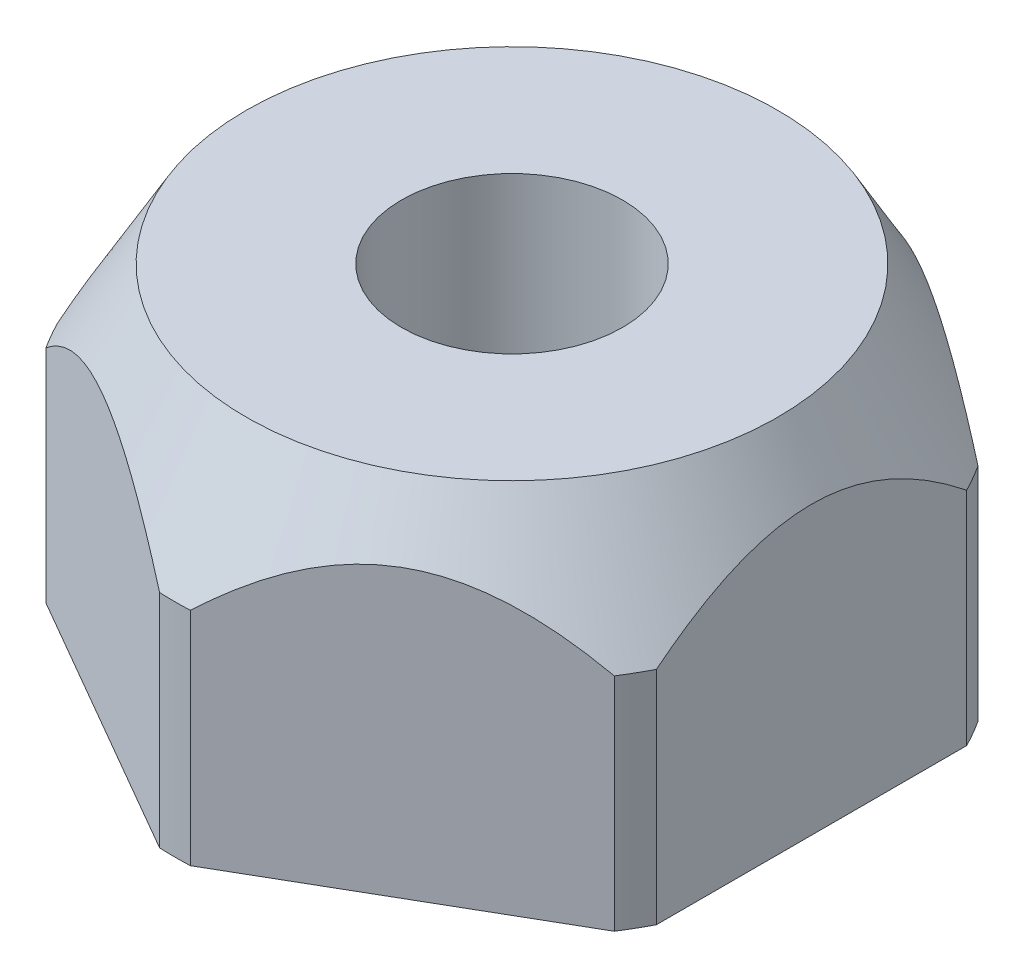
ISO-10303-21;
HEADER;
FILE_DESCRIPTION(('STEP AP214'),'2;1');
FILE_NAME('part.step','',(''),(''),'','','');
FILE_SCHEMA(('AUTOMOTIVE_DESIGN { 1 0 10303 214 1 1 1 1 }'));
ENDSEC;
DATA;
#1=APPLICATION_CONTEXT('core data for automotive mechanical design processes');
#2=APPLICATION_PROTOCOL_DEFINITION('international standard','automotive_design',2000,#1);
#3=PRODUCT_CONTEXT('',#1,'mechanical');
#4=PRODUCT('Part','Part','',(#3));
#5=PRODUCT_RELATED_PRODUCT_CATEGORY('part','',(#4));
#6=PRODUCT_DEFINITION_FORMATION('','',#4);
#7=PRODUCT_DEFINITION_CONTEXT('part definition',#1,'design');
#8=PRODUCT_DEFINITION('design','',#6,#7);
#9=PRODUCT_DEFINITION_SHAPE('','',#8);
#10=(LENGTH_UNIT() NAMED_UNIT(*) SI_UNIT(.MILLI.,.METRE.));
#11=(NAMED_UNIT(*) PLANE_ANGLE_UNIT() SI_UNIT($,.RADIAN.));
#12=(NAMED_UNIT(*) SI_UNIT($,.STERADIAN.) SOLID_ANGLE_UNIT());
#13=UNCERTAINTY_MEASURE_WITH_UNIT(LENGTH_MEASURE(1.E-05),#10,'distance_accuracy_value','');
#14=(GEOMETRIC_REPRESENTATION_CONTEXT(3) GLOBAL_UNCERTAINTY_ASSIGNED_CONTEXT((#13)) GLOBAL_UNIT_ASSIGNED_CONTEXT((#10,
#11,#12)) REPRESENTATION_CONTEXT('',''));
#15=CARTESIAN_POINT('',(0.,0.,0.));
#16=DIRECTION('',(0.,0.,1.));
#17=DIRECTION('',(1.,0.,0.));
#18=AXIS2_PLACEMENT_3D('',#15,#16,#17);
#19=CARTESIAN_POINT('',(0.,4.5212,0.));
#20=DIRECTION('',(0.,1.,0.));
#21=DIRECTION('',(-1.,0.,0.));
#22=AXIS2_PLACEMENT_3D('',#19,#20,#21);
#23=CYLINDRICAL_SURFACE('',#22,4.4196);
#24=DIRECTION('',(0.,1.,0.));
#25=VECTOR('',#24,1.);
#26=CARTESIAN_POINT('',(3.72270396182565,4.5212,-2.38208718828837));
#27=LINE('',#26,#25);
#28=CARTESIAN_POINT('',(3.72270396182565,2.89764571680006,-2.38208718828837));
#29=VERTEX_POINT('',#28);
#30=CARTESIAN_POINT('',(3.72270396182565,0.,-2.38208718828837));
#31=VERTEX_POINT('',#30);
#32=EDGE_CURVE('E199',#29,#31,#27,.F.);
#33=ORIENTED_EDGE('',*,*,#32,.F.);
#34=CARTESIAN_POINT('',(0.,2.89764571680006,0.));
#35=DIRECTION('',(0.,1.,0.));
#36=DIRECTION('',(-1.,0.,0.));
#37=AXIS2_PLACEMENT_3D('',#34,#35,#36);
#38=CIRCLE('',#37,4.4196);
#39=CARTESIAN_POINT('',(3.9243,2.89764571680006,-2.03291260756581));
#40=VERTEX_POINT('',#39);
#41=EDGE_CURVE('E175',#40,#29,#38,.T.);
#42=ORIENTED_EDGE('',*,*,#41,.F.);
#43=DIRECTION('',(0.,1.,0.));
#44=VECTOR('',#43,1.);
#45=CARTESIAN_POINT('',(3.9243,4.5212,-2.03291260756581));
#46=LINE('',#45,#44);
#47=CARTESIAN_POINT('',(3.9243,0.,-2.03291260756581));
#48=VERTEX_POINT('',#47);
#49=EDGE_CURVE('E157',#48,#40,#46,.T.);
#50=ORIENTED_EDGE('',*,*,#49,.F.);
#51=CARTESIAN_POINT('',(0.,0.,0.));
#52=DIRECTION('',(0.,1.,0.));
#53=DIRECTION('',(-1.,0.,0.));
#54=AXIS2_PLACEMENT_3D('',#51,#52,#53);
#55=CIRCLE('',#54,4.4196);
#56=EDGE_CURVE('E173',#48,#31,#55,.T.);
#57=ORIENTED_EDGE('',*,*,#56,.T.);
#58=EDGE_LOOP('',(#33,#42,#50,#57));
#59=FACE_BOUND('',#58,.T.);
#60=ADVANCED_FACE('F42',(#59),#23,.T.);
#61=DIRECTION('',(0.,1.,0.));
#62=VECTOR('',#61,1.);
#63=CARTESIAN_POINT('',(0.201596038174351,4.5212,-4.41499979585417));
#64=LINE('',#63,#62);
#65=CARTESIAN_POINT('',(0.201596038174351,0.,-4.41499979585417));
#66=VERTEX_POINT('',#65);
#67=CARTESIAN_POINT('',(0.201596038174351,2.89764571680006,-4.41499979585417));
#68=VERTEX_POINT('',#67);
#69=EDGE_CURVE('E240',#66,#68,#64,.T.);
#70=ORIENTED_EDGE('',*,*,#69,.F.);
#71=CARTESIAN_POINT('',(-0.201596038174352,0.,-4.41499979585417));
#72=VERTEX_POINT('',#71);
#73=EDGE_CURVE('E185',#66,#72,#55,.T.);
#74=ORIENTED_EDGE('',*,*,#73,.T.);
#75=DIRECTION('',(0.,1.,0.));
#76=VECTOR('',#75,1.);
#77=CARTESIAN_POINT('',(-0.201596038174351,4.5212,-4.41499979585417));
#78=LINE('',#77,#76);
#79=CARTESIAN_POINT('',(-0.201596038174351,2.89764571680006,-4.41499979585417));
#80=VERTEX_POINT('',#79);
#81=EDGE_CURVE('E70',#80,#72,#78,.F.);
#82=ORIENTED_EDGE('',*,*,#81,.F.);
#83=EDGE_CURVE('E367',#68,#80,#38,.T.);
#84=ORIENTED_EDGE('',*,*,#83,.F.);
#85=EDGE_LOOP('',(#70,#74,#82,#84));
#86=FACE_BOUND('',#85,.T.);
#87=ADVANCED_FACE('F280',(#86),#23,.T.);
#88=DIRECTION('',(0.,1.,0.));
#89=VECTOR('',#88,1.);
#90=CARTESIAN_POINT('',(-3.72270396182565,4.5212,-2.38208718828837));
#91=LINE('',#90,#89);
#92=CARTESIAN_POINT('',(-3.72270396182565,0.,-2.38208718828837));
#93=VERTEX_POINT('',#92);
#94=CARTESIAN_POINT('',(-3.72270396182565,2.89764571680006,-2.38208718828837));
#95=VERTEX_POINT('',#94);
#96=EDGE_CURVE('E227',#93,#95,#91,.T.);
#97=ORIENTED_EDGE('',*,*,#96,.F.);
#98=CARTESIAN_POINT('',(-3.9243,0.,-2.0329126075658));
#99=VERTEX_POINT('',#98);
#100=EDGE_CURVE('E193',#93,#99,#55,.T.);
#101=ORIENTED_EDGE('',*,*,#100,.T.);
#102=DIRECTION('',(0.,1.,0.));
#103=VECTOR('',#102,1.);
#104=CARTESIAN_POINT('',(-3.9243,4.5212,-2.0329126075658));
#105=LINE('',#104,#103);
#106=CARTESIAN_POINT('',(-3.9243,2.89764571680006,-2.0329126075658));
#107=VERTEX_POINT('',#106);
#108=EDGE_CURVE('E61',#107,#99,#105,.F.);
#109=ORIENTED_EDGE('',*,*,#108,.F.);
#110=EDGE_CURVE('E212',#95,#107,#38,.T.);
#111=ORIENTED_EDGE('',*,*,#110,.F.);
#112=EDGE_LOOP('',(#97,#101,#109,#111));
#113=FACE_BOUND('',#112,.T.);
#114=ADVANCED_FACE('F233',(#113),#23,.T.);
#115=DIRECTION('',(0.,1.,0.));
#116=VECTOR('',#115,1.);
#117=CARTESIAN_POINT('',(-3.9243,4.5212,2.0329126075658));
#118=LINE('',#117,#116);
#119=CARTESIAN_POINT('',(-3.9243,0.,2.0329126075658));
#120=VERTEX_POINT('',#119);
#121=CARTESIAN_POINT('',(-3.9243,2.89764571680005,2.03291260756582));
#122=VERTEX_POINT('',#121);
#123=EDGE_CURVE('E356',#120,#122,#118,.T.);
#124=ORIENTED_EDGE('',*,*,#123,.F.);
#125=CARTESIAN_POINT('',(-3.72270396182565,0.,2.38208718828837));
#126=VERTEX_POINT('',#125);
#127=EDGE_CURVE('E194',#120,#126,#55,.T.);
#128=ORIENTED_EDGE('',*,*,#127,.T.);
#129=DIRECTION('',(0.,1.,0.));
#130=VECTOR('',#129,1.);
#131=CARTESIAN_POINT('',(-3.72270396182565,4.5212,2.38208718828837));
#132=LINE('',#131,#130);
#133=CARTESIAN_POINT('',(-3.72270396182565,2.89764571680006,2.38208718828837));
#134=VERTEX_POINT('',#133);
#135=EDGE_CURVE('E321',#134,#126,#132,.F.);
#136=ORIENTED_EDGE('',*,*,#135,.F.);
#137=EDGE_CURVE('E167',#122,#134,#38,.T.);
#138=ORIENTED_EDGE('',*,*,#137,.F.);
#139=EDGE_LOOP('',(#124,#128,#136,#138));
#140=FACE_BOUND('',#139,.T.);
#141=ADVANCED_FACE('F291',(#140),#23,.T.);
#142=DIRECTION('',(0.,1.,0.));
#143=VECTOR('',#142,1.);
#144=CARTESIAN_POINT('',(-0.20159603817435,4.5212,4.41499979585417));
#145=LINE('',#144,#143);
#146=CARTESIAN_POINT('',(-0.201596038174349,0.,4.41499979585417));
#147=VERTEX_POINT('',#146);
#148=CARTESIAN_POINT('',(-0.20159603817435,2.89764571680006,4.41499979585417));
#149=VERTEX_POINT('',#148);
#150=EDGE_CURVE('E312',#147,#149,#145,.T.);
#151=ORIENTED_EDGE('',*,*,#150,.F.);
#152=CARTESIAN_POINT('',(0.201596038174345,0.,4.41499979585417));
#153=VERTEX_POINT('',#152);
#154=EDGE_CURVE('E190',#147,#153,#55,.T.);
#155=ORIENTED_EDGE('',*,*,#154,.T.);
#156=DIRECTION('',(0.,1.,0.));
#157=VECTOR('',#156,1.);
#158=CARTESIAN_POINT('',(0.201596038174346,4.5212,4.41499979585417));
#159=LINE('',#158,#157);
#160=CARTESIAN_POINT('',(0.201596038174346,2.89764571680006,4.41499979585417));
#161=VERTEX_POINT('',#160);
#162=EDGE_CURVE('E301',#161,#153,#159,.F.);
#163=ORIENTED_EDGE('',*,*,#162,.F.);
#164=EDGE_CURVE('E214',#149,#161,#38,.T.);
#165=ORIENTED_EDGE('',*,*,#164,.F.);
#166=EDGE_LOOP('',(#151,#155,#163,#165));
#167=FACE_BOUND('',#166,.T.);
#168=ADVANCED_FACE('F286',(#167),#23,.T.);
#169=DIRECTION('',(0.,1.,0.));
#170=VECTOR('',#169,1.);
#171=CARTESIAN_POINT('',(3.72270396182565,4.5212,2.38208718828837));
#172=LINE('',#171,#170);
#173=CARTESIAN_POINT('',(3.72270396182565,0.,2.38208718828837));
#174=VERTEX_POINT('',#173);
#175=CARTESIAN_POINT('',(3.72270396182565,2.89764571680006,2.38208718828837));
#176=VERTEX_POINT('',#175);
#177=EDGE_CURVE('E295',#174,#176,#172,.T.);
#178=ORIENTED_EDGE('',*,*,#177,.F.);
#179=CARTESIAN_POINT('',(3.9243,0.,2.03291260756581));
#180=VERTEX_POINT('',#179);
#181=EDGE_CURVE('E184',#174,#180,#55,.T.);
#182=ORIENTED_EDGE('',*,*,#181,.T.);
#183=DIRECTION('',(0.,1.,0.));
#184=VECTOR('',#183,1.);
#185=CARTESIAN_POINT('',(3.9243,4.5212,2.03291260756581));
#186=LINE('',#185,#184);
#187=CARTESIAN_POINT('',(3.9243,2.89764571680005,2.03291260756583));
#188=VERTEX_POINT('',#187);
#189=EDGE_CURVE('E160',#188,#180,#186,.F.);
#190=ORIENTED_EDGE('',*,*,#189,.F.);
#191=EDGE_CURVE('E297',#176,#188,#38,.T.);
#192=ORIENTED_EDGE('',*,*,#191,.F.);
#193=EDGE_LOOP('',(#178,#182,#190,#192));
#194=FACE_BOUND('',#193,.T.);
#195=ADVANCED_FACE('F44',(#194),#23,.T.);
#196=CARTESIAN_POINT('',(0.,4.5212,0.));
#197=DIRECTION('',(0.,-1.,0.));
#198=DIRECTION('',(1.,0.,0.));
#199=AXIS2_PLACEMENT_3D('',#196,#197,#198);
#200=CONICAL_SURFACE('',#199,3.48224049755053,0.523598775598307);
#201=CARTESIAN_POINT('',(0.201378646395307,2.89744571680006,-4.41512530705632));
#202=CARTESIAN_POINT('',(0.243002688833909,2.93573712645072,-4.39109365494964));
#203=CARTESIAN_POINT('',(0.285074251898576,2.97337922098922,-4.36680362668902));
#204=CARTESIAN_POINT('',(0.370206681949156,3.04717777314053,-4.31765239528255));
#205=CARTESIAN_POINT('',(0.413267908892586,3.08333367642834,-4.29279098431513));
#206=CARTESIAN_POINT('',(0.544599933654743,3.18971037495322,-4.21696640446548));
#207=CARTESIAN_POINT('',(0.634477673899376,3.25733473471823,-4.16507546694109));
#208=CARTESIAN_POINT('',(0.821144915873365,3.38487757851598,-4.05730308453852));
#209=CARTESIAN_POINT('',(0.918046421063457,3.44458078367558,-4.00135697443214));
#210=CARTESIAN_POINT('',(1.11680543627588,3.55102543367785,-3.88660340349538));
#211=CARTESIAN_POINT('',(1.218647548972,3.59780444515529,-3.82780483231544));
#212=CARTESIAN_POINT('',(1.43529451423899,3.67787617965486,-3.70272364859942));
#213=CARTESIAN_POINT('',(1.55048857316493,3.70981655679631,-3.63621632766949));
#214=CARTESIAN_POINT('',(1.78281413271054,3.74995513125242,-3.5020831033262));
#215=CARTESIAN_POINT('',(1.89991230733974,3.7584005945101,-3.43447644068241));
#216=CARTESIAN_POINT('',(2.13361293691471,3.75090530137457,-3.29954931928752));
#217=CARTESIAN_POINT('',(2.2502147736126,3.73493996899139,-3.23222921748199));
#218=CARTESIAN_POINT('',(2.4806112780335,3.68075542544333,-3.09920973363423));
#219=CARTESIAN_POINT('',(2.59436313462659,3.64230230903893,-3.0335350686094));
#220=CARTESIAN_POINT('',(2.79918417335044,3.55483104413837,-2.91528158676648));
#221=CARTESIAN_POINT('',(2.89107892955647,3.50829606479648,-2.86222612453382));
#222=CARTESIAN_POINT('',(3.07070088952971,3.40515033107087,-2.75852133759089));
#223=CARTESIAN_POINT('',(3.1584193246077,3.34851946739325,-2.70787707548573));
#224=CARTESIAN_POINT('',(3.32771219466592,3.22903572151362,-2.61013579138573));
#225=CARTESIAN_POINT('',(3.40938284458361,3.16636154115019,-2.56298321967086));
#226=CARTESIAN_POINT('',(3.56883955872649,3.03560761551068,-2.47092084283637));
#227=CARTESIAN_POINT('',(3.64664238475491,2.96755525608414,-2.42600136028515));
#228=CARTESIAN_POINT('',(3.7229213536047,2.89744571680005,-2.38196167708622));
#229=B_SPLINE_CURVE_WITH_KNOTS('',3,(#201,#202,#203,#204,#205,#206,#207,#208,#209,#210,#211,
#212,#213,#214,#215,#216,#217,#218,#219,#220,#221,#222,#223,#224,#225,#226,#227,#228),
.UNSPECIFIED.,.F.,.F.,(4,2,2,2,2,2,2,2,2,2,2,2,2,4),(0.,0.184345090143029,0.368758325377625,
0.739992068313383,1.11984200873029,1.49857594003078,1.90713875884581,2.3113852005117,
2.71603889232377,3.12497836793815,3.4719638581063,3.81964836787163,4.15911497599774,
4.49695241990035),.UNSPECIFIED.);
#230=EDGE_CURVE('E245',#68,#29,#229,.T.);
#231=ORIENTED_EDGE('',*,*,#230,.F.);
#232=ORIENTED_EDGE('',*,*,#83,.T.);
#233=CARTESIAN_POINT('',(-3.7229213536047,2.89744571680005,-2.38196167708622));
#234=CARTESIAN_POINT('',(-3.6812973111661,2.93573712645071,-2.4059933291929));
#235=CARTESIAN_POINT('',(-3.63922574810143,2.97337922098922,-2.43028335745352));
#236=CARTESIAN_POINT('',(-3.55409331805085,3.04717777314052,-2.47943458885999));
#237=CARTESIAN_POINT('',(-3.51103209110742,3.08333367642834,-2.50429599982741));
#238=CARTESIAN_POINT('',(-3.37970006634527,3.18971037495322,-2.58012057967706));
#239=CARTESIAN_POINT('',(-3.28982232610063,3.25733473471822,-2.63201151720146));
#240=CARTESIAN_POINT('',(-3.10315508412664,3.38487757851598,-2.73978389960402));
#241=CARTESIAN_POINT('',(-3.00625357893655,3.44458078367558,-2.7957300097104));
#242=CARTESIAN_POINT('',(-2.80749456372413,3.55102543367784,-2.91048358064716));
#243=CARTESIAN_POINT('',(-2.70565245102801,3.59780444515529,-2.9692821518271));
#244=CARTESIAN_POINT('',(-2.48900548576102,3.67787617965485,-3.09436333554312));
#245=CARTESIAN_POINT('',(-2.37381142683508,3.70981655679631,-3.16087065647305));
#246=CARTESIAN_POINT('',(-2.14148586728947,3.74995513125242,-3.29500388081634));
#247=CARTESIAN_POINT('',(-2.02438769266027,3.7584005945101,-3.36261054346013));
#248=CARTESIAN_POINT('',(-1.7906870630853,3.75090530137457,-3.49753766485502));
#249=CARTESIAN_POINT('',(-1.67408522638741,3.7349399689914,-3.56485776666055));
#250=CARTESIAN_POINT('',(-1.44368872196651,3.68075542544333,-3.69787725050831));
#251=CARTESIAN_POINT('',(-1.32993686537342,3.64230230903893,-3.76355191553314));
#252=CARTESIAN_POINT('',(-1.12511582664957,3.55483104413837,-3.88180539737606));
#253=CARTESIAN_POINT('',(-1.03322107044354,3.50829606479649,-3.93486085960873));
#254=CARTESIAN_POINT('',(-0.853599110470297,3.40515033107087,-4.03856564655165));
#255=CARTESIAN_POINT('',(-0.765880675392313,3.34851946739326,-4.08920990865681));
#256=CARTESIAN_POINT('',(-0.596587805334092,3.22903572151363,-4.18695119275681));
#257=CARTESIAN_POINT('',(-0.514917155416397,3.1663615411502,-4.23410376447168));
#258=CARTESIAN_POINT('',(-0.355460441273519,3.03560761551069,-4.32616614130617));
#259=CARTESIAN_POINT('',(-0.277657615245102,2.96755525608415,-4.37108562385739));
#260=CARTESIAN_POINT('',(-0.201378646395307,2.89744571680006,-4.41512530705632));
#261=B_SPLINE_CURVE_WITH_KNOTS('',3,(#233,#234,#235,#236,#237,#238,#239,#240,#241,#242,#243,
#244,#245,#246,#247,#248,#249,#250,#251,#252,#253,#254,#255,#256,#257,#258,#259,#260),
.UNSPECIFIED.,.F.,.F.,(4,2,2,2,2,2,2,2,2,2,2,2,2,4),(0.,0.184345090143029,0.368758325377625,
0.739992068313384,1.11984200873029,1.49857594003079,1.90713875884581,2.31138520051171,
2.71603889232377,3.12497836793816,3.4719638581063,3.81964836787163,4.15911497599774,
4.49695241990034),.UNSPECIFIED.);
#262=EDGE_CURVE('E236',#95,#80,#261,.T.);
#263=ORIENTED_EDGE('',*,*,#262,.F.);
#264=ORIENTED_EDGE('',*,*,#110,.T.);
#265=CARTESIAN_POINT('',(-3.9243,-5.87380782557374,-8.63379129520373));
#266=CARTESIAN_POINT('',(-3.9243,-5.58964286938288,-8.45355593513878));
#267=CARTESIAN_POINT('',(-3.9243,-5.30589522438469,-8.27265816557873));
#268=CARTESIAN_POINT('',(-3.9243,-4.73944838253155,-7.90919357757867));
#269=CARTESIAN_POINT('',(-3.9243,-4.45674924687053,-7.72662666381215));
#270=CARTESIAN_POINT('',(-3.9243,-3.89179400145961,-7.35894572743985));
#271=CARTESIAN_POINT('',(-3.9243,-3.60954180925933,-7.17382567678761));
#272=CARTESIAN_POINT('',(-3.9243,-3.04668309623803,-6.80111721439275));
#273=CARTESIAN_POINT('',(-3.9243,-2.76607652358586,-6.61352888100245));
#274=CARTESIAN_POINT('',(-3.9243,-2.17874914148297,-6.21618149631846));
#275=CARTESIAN_POINT('',(-3.9243,-1.8722493542194,-6.00609478205519));
#276=CARTESIAN_POINT('',(-3.9243,-1.2626331318594,-5.58099180262799));
#277=CARTESIAN_POINT('',(-3.9243,-0.959517050733292,-5.36597502878301));
#278=CARTESIAN_POINT('',(-3.9243,-0.35855230177701,-4.92970380860127));
#279=CARTESIAN_POINT('',(-3.9243,-0.060695582010741,-4.70846054388232));
#280=CARTESIAN_POINT('',(-3.9243,0.380757835234389,-4.36969669549216));
#281=CARTESIAN_POINT('',(-3.9243,0.527008292446811,-4.25563546669555));
#282=CARTESIAN_POINT('',(-3.9243,0.817287951568911,-4.02472547436633));
#283=CARTESIAN_POINT('',(-3.9243,0.961317270900784,-3.90787685902861));
#284=CARTESIAN_POINT('',(-3.9243,1.20900848594877,-3.70200165467747));
#285=CARTESIAN_POINT('',(-3.9243,1.31331413034915,-3.61375017193311));
#286=CARTESIAN_POINT('',(-3.9243,1.52007701334346,-3.43509629501821));
#287=CARTESIAN_POINT('',(-3.9243,1.62253419982915,-3.34469384037758));
#288=CARTESIAN_POINT('',(-3.9243,1.82537344432241,-3.16119172938196));
#289=CARTESIAN_POINT('',(-3.9243,1.92575108110659,-3.06808717133467));
#290=CARTESIAN_POINT('',(-3.9243,2.12365413528848,-2.87889417516989));
#291=CARTESIAN_POINT('',(-3.9243,2.22117972595293,-2.7828059190515));
#292=CARTESIAN_POINT('',(-3.9243,2.41081224427405,-2.5889155437287));
#293=CARTESIAN_POINT('',(-3.9243,2.50298659907945,-2.49117968490803));
#294=CARTESIAN_POINT('',(-3.9243,2.68287198547388,-2.29160114585912));
#295=CARTESIAN_POINT('',(-3.9243,2.77058166928826,-2.18975724194887));
#296=CARTESIAN_POINT('',(-3.9243,2.93981076454091,-1.98155789228631));
#297=CARTESIAN_POINT('',(-3.9243,3.02134917254444,-1.87521800513253));
#298=CARTESIAN_POINT('',(-3.9243,3.17649864518206,-1.65694963490632));
#299=CARTESIAN_POINT('',(-3.9243,3.25011654126105,-1.54502609171099));
#300=CARTESIAN_POINT('',(-3.9243,3.35948778615387,-1.36056405232588));
#301=CARTESIAN_POINT('',(-3.9243,3.3986581290361,-1.29005960112683));
#302=CARTESIAN_POINT('',(-3.9243,3.47231673158247,-1.14664541023704));
#303=CARTESIAN_POINT('',(-3.9243,3.50680414548727,-1.07373523900949));
#304=CARTESIAN_POINT('',(-3.9243,3.6017037872312,-0.85169513625506));
#305=CARTESIAN_POINT('',(-3.9243,3.65384598832468,-0.698783402481794));
#306=CARTESIAN_POINT('',(-3.9243,3.72125862440976,-0.414375721124633));
#307=CARTESIAN_POINT('',(-3.9243,3.74153228763838,-0.284085210312981));
#308=CARTESIAN_POINT('',(-3.9243,3.75920323472214,-0.0218768313064437));
#309=CARTESIAN_POINT('',(-3.9243,3.75660117281652,0.110040990240066));
#310=CARTESIAN_POINT('',(-3.9243,3.72894702535028,0.371034328665205));
#311=CARTESIAN_POINT('',(-3.9243,3.7039555252625,0.500116553480642));
#312=CARTESIAN_POINT('',(-3.9243,3.63493261062312,0.7529780698682));
#313=CARTESIAN_POINT('',(-3.9243,3.59089182871347,0.876754719503425));
#314=CARTESIAN_POINT('',(-3.9243,3.49432043207937,1.10314912209663));
#315=CARTESIAN_POINT('',(-3.9243,3.44347694361856,1.20650790848841));
#316=CARTESIAN_POINT('',(-3.9243,3.33293331391539,1.40842680911294));
#317=CARTESIAN_POINT('',(-3.9243,3.27322584092506,1.50698286031848));
#318=CARTESIAN_POINT('',(-3.9243,3.14635490565401,1.70065780687327));
#319=CARTESIAN_POINT('',(-3.9243,3.07911730261507,1.79572756015731));
#320=CARTESIAN_POINT('',(-3.9243,2.939351909161,1.98179076211418));
#321=CARTESIAN_POINT('',(-3.9243,2.86682665414167,2.07278613108027));
#322=CARTESIAN_POINT('',(-3.9243,2.72226307027854,2.24575017492362));
#323=CARTESIAN_POINT('',(-3.9243,2.65047395227167,2.32792855558461));
#324=CARTESIAN_POINT('',(-3.9243,2.50395662346823,2.48962939161582));
#325=CARTESIAN_POINT('',(-3.9243,2.42922801787163,2.56915148755219));
#326=CARTESIAN_POINT('',(-3.9243,2.20139453856917,2.80437018757481));
#327=CARTESIAN_POINT('',(-3.9243,2.04472951561085,2.95661718807237));
#328=CARTESIAN_POINT('',(-3.9243,1.72436552397984,3.25466769588499));
#329=CARTESIAN_POINT('',(-3.9243,1.56064217265613,3.40044462879705));
#330=CARTESIAN_POINT('',(-3.9243,1.2285037793297,3.6865751897645));
#331=CARTESIAN_POINT('',(-3.9243,1.06008811012746,3.82692808677206));
#332=CARTESIAN_POINT('',(-3.9243,0.733968216819453,4.09183149253688));
#333=CARTESIAN_POINT('',(-3.9243,0.57654059248636,4.21672433969304));
#334=CARTESIAN_POINT('',(-3.9243,0.259385992588557,4.46358469856286));
#335=CARTESIAN_POINT('',(-3.9243,0.0996587755311476,4.58555189939948));
#336=CARTESIAN_POINT('',(-3.9243,-0.22017094037556,4.82597958614242));
#337=CARTESIAN_POINT('',(-3.9243,-0.380257212293098,4.94446171729388));
#338=CARTESIAN_POINT('',(-3.9243,-0.701864312356236,5.17939164760606));
#339=CARTESIAN_POINT('',(-3.9243,-0.8633848263716,5.295839876429));
#340=CARTESIAN_POINT('',(-3.9243,-1.02548199442387,5.41146916723737));
#341=B_SPLINE_CURVE_WITH_KNOTS('',3,(#265,#266,#267,#268,#269,#270,#271,#272,#273,#274,#275,
#276,#277,#278,#279,#280,#281,#282,#283,#284,#285,#286,#287,#288,#289,#290,#291,#292,#293,#294,
#295,#296,#297,#298,#299,#300,#301,#302,#303,#304,#305,#306,#307,#308,#309,#310,#311,#312,#313,
#314,#315,#316,#317,#318,#319,#320,#321,#322,#323,#324,#325,#326,#327,#328,#329,#330,#331,#332,
#333,#334,#335,#336,#337,#338,#339,#340),.UNSPECIFIED.,.F.,.F.,(4,2,2,2,2,2,2,2,2,2,2,2,2,2,2,2,
2,2,2,2,2,2,2,2,2,2,2,2,2,2,2,2,2,2,2,2,2,4),(0.,1.00951269066253,2.01908340031431,
3.03170361538688,4.04429176336791,5.1590217229326,6.27386722200635,7.38682449596562,
7.94320958840621,8.49956516557767,8.90943405719607,9.31931448507023,9.72999171618565,
10.1406439458991,10.5435698771038,10.9466167290678,11.3483676832058,11.7497693011965,
11.9915734636186,12.2334212391062,12.7154641153318,13.1092420405207,13.5030087038095,
13.8957130483039,14.2886107224912,14.633659408222,14.9789951039688,15.3280929568146,
15.6770245065828,16.0042971625776,16.3316139253778,16.9866499157622,17.6441656189178,
18.3017696347011,18.9045859362486,19.5074660113789,20.1049366045304,20.7022794169288),.UNSPECIFIED.);
#342=EDGE_CURVE('E351',#122,#107,#341,.F.);
#343=ORIENTED_EDGE('',*,*,#342,.F.);
#344=ORIENTED_EDGE('',*,*,#137,.T.);
#345=CARTESIAN_POINT('',(-0.201378646395305,2.89744571680006,4.41512530705632));
#346=CARTESIAN_POINT('',(-0.243002688833907,2.93573712645072,4.39109365494964));
#347=CARTESIAN_POINT('',(-0.285074251898573,2.97337922098922,4.36680362668902));
#348=CARTESIAN_POINT('',(-0.370206681949154,3.04717777314053,4.31765239528255));
#349=CARTESIAN_POINT('',(-0.413267908892583,3.08333367642834,4.29279098431513));
#350=CARTESIAN_POINT('',(-0.544599933654741,3.18971037495322,4.21696640446548));
#351=CARTESIAN_POINT('',(-0.634477673899374,3.25733473471823,4.16507546694109));
#352=CARTESIAN_POINT('',(-0.821144915873363,3.38487757851598,4.05730308453852));
#353=CARTESIAN_POINT('',(-0.918046421063455,3.44458078367558,4.00135697443214));
#354=CARTESIAN_POINT('',(-1.11680543627588,3.55102543367785,3.88660340349538));
#355=CARTESIAN_POINT('',(-1.218647548972,3.59780444515529,3.82780483231544));
#356=CARTESIAN_POINT('',(-1.43529451423899,3.67787617965486,3.70272364859942));
#357=CARTESIAN_POINT('',(-1.55048857316493,3.70981655679631,3.63621632766949));
#358=CARTESIAN_POINT('',(-1.78281413271054,3.74995513125242,3.5020831033262));
#359=CARTESIAN_POINT('',(-1.89991230733974,3.7584005945101,3.43447644068242));
#360=CARTESIAN_POINT('',(-2.13361293691471,3.75090530137457,3.29954931928752));
#361=CARTESIAN_POINT('',(-2.2502147736126,3.7349399689914,3.23222921748199));
#362=CARTESIAN_POINT('',(-2.4806112780335,3.68075542544333,3.09920973363423));
#363=CARTESIAN_POINT('',(-2.59436313462658,3.64230230903892,3.0335350686094));
#364=CARTESIAN_POINT('',(-2.79918417335044,3.55483104413836,2.91528158676648));
#365=CARTESIAN_POINT('',(-2.89107892955647,3.50829606479648,2.86222612453382));
#366=CARTESIAN_POINT('',(-3.07070088952971,3.40515033107087,2.75852133759089));
#367=CARTESIAN_POINT('',(-3.1584193246077,3.34851946739325,2.70787707548573));
#368=CARTESIAN_POINT('',(-3.32771219466592,3.22903572151362,2.61013579138573));
#369=CARTESIAN_POINT('',(-3.40938284458361,3.16636154115019,2.56298321967086));
#370=CARTESIAN_POINT('',(-3.56883955872649,3.03560761551068,2.47092084283637));
#371=CARTESIAN_POINT('',(-3.64664238475491,2.96755525608414,2.42600136028515));
#372=CARTESIAN_POINT('',(-3.7229213536047,2.89744571680005,2.38196167708622));
#373=B_SPLINE_CURVE_WITH_KNOTS('',3,(#345,#346,#347,#348,#349,#350,#351,#352,#353,#354,#355,
#356,#357,#358,#359,#360,#361,#362,#363,#364,#365,#366,#367,#368,#369,#370,#371,#372),
.UNSPECIFIED.,.F.,.F.,(4,2,2,2,2,2,2,2,2,2,2,2,2,4),(0.,0.184345090143029,0.368758325377624,
0.739992068313383,1.11984200873029,1.49857594003079,1.90713875884581,2.3113852005117,
2.71603889232377,3.12497836793815,3.4719638581063,3.81964836787163,4.15911497599774,
4.49695241990035),.UNSPECIFIED.);
#374=EDGE_CURVE('E317',#149,#134,#373,.T.);
#375=ORIENTED_EDGE('',*,*,#374,.F.);
#376=ORIENTED_EDGE('',*,*,#164,.T.);
#377=CARTESIAN_POINT('',(3.72292135360471,2.89744571680005,2.38196167708621));
#378=CARTESIAN_POINT('',(3.6812973111661,2.93573712645071,2.4059933291929));
#379=CARTESIAN_POINT('',(3.63922574810144,2.97337922098922,2.43028335745351));
#380=CARTESIAN_POINT('',(3.55409331805086,3.04717777314052,2.47943458885998));
#381=CARTESIAN_POINT('',(3.51103209110743,3.08333367642834,2.50429599982741));
#382=CARTESIAN_POINT('',(3.37970006634527,3.18971037495322,2.58012057967706));
#383=CARTESIAN_POINT('',(3.28982232610064,3.25733473471822,2.63201151720145));
#384=CARTESIAN_POINT('',(3.10315508412665,3.38487757851598,2.73978389960402));
#385=CARTESIAN_POINT('',(3.00625357893656,3.44458078367558,2.7957300097104));
#386=CARTESIAN_POINT('',(2.80749456372413,3.55102543367785,2.91048358064716));
#387=CARTESIAN_POINT('',(2.70565245102802,3.59780444515529,2.9692821518271));
#388=CARTESIAN_POINT('',(2.48900548576102,3.67787617965486,3.09436333554311));
#389=CARTESIAN_POINT('',(2.37381142683508,3.70981655679631,3.16087065647305));
#390=CARTESIAN_POINT('',(2.14148586728947,3.74995513125242,3.29500388081634));
#391=CARTESIAN_POINT('',(2.02438769266027,3.7584005945101,3.36261054346012));
#392=CARTESIAN_POINT('',(1.7906870630853,3.75090530137457,3.49753766485501));
#393=CARTESIAN_POINT('',(1.67408522638741,3.7349399689914,3.56485776666055));
#394=CARTESIAN_POINT('',(1.44368872196651,3.68075542544334,3.6978772505083));
#395=CARTESIAN_POINT('',(1.32993686537343,3.64230230903893,3.76355191553314));
#396=CARTESIAN_POINT('',(1.12511582664957,3.55483104413837,3.88180539737606));
#397=CARTESIAN_POINT('',(1.03322107044354,3.50829606479649,3.93486085960872));
#398=CARTESIAN_POINT('',(0.853599110470297,3.40515033107088,4.03856564655164));
#399=CARTESIAN_POINT('',(0.765880675392313,3.34851946739326,4.08920990865681));
#400=CARTESIAN_POINT('',(0.596587805334091,3.22903572151363,4.18695119275681));
#401=CARTESIAN_POINT('',(0.514917155416395,3.1663615411502,4.23410376447168));
#402=CARTESIAN_POINT('',(0.355460441273515,3.03560761551069,4.32616614130617));
#403=CARTESIAN_POINT('',(0.277657615245097,2.96755525608415,4.37108562385739));
#404=CARTESIAN_POINT('',(0.201378646395302,2.89744571680006,4.41512530705632));
#405=B_SPLINE_CURVE_WITH_KNOTS('',3,(#377,#378,#379,#380,#381,#382,#383,#384,#385,#386,#387,
#388,#389,#390,#391,#392,#393,#394,#395,#396,#397,#398,#399,#400,#401,#402,#403,#404),
.UNSPECIFIED.,.F.,.F.,(4,2,2,2,2,2,2,2,2,2,2,2,2,4),(0.,0.184345090143029,0.368758325377625,
0.739992068313384,1.11984200873029,1.49857594003079,1.90713875884581,2.3113852005117,
2.71603889232377,3.12497836793816,3.4719638581063,3.81964836787163,4.15911497599774,
4.49695241990036),.UNSPECIFIED.);
#406=EDGE_CURVE('E302',#176,#161,#405,.T.);
#407=ORIENTED_EDGE('',*,*,#406,.F.);
#408=ORIENTED_EDGE('',*,*,#191,.T.);
#409=CARTESIAN_POINT('',(3.9243,-5.87380782557374,-8.63379129520373));
#410=CARTESIAN_POINT('',(3.9243,-5.58964286938288,-8.45355593513878));
#411=CARTESIAN_POINT('',(3.9243,-5.30589522438469,-8.27265816557873));
#412=CARTESIAN_POINT('',(3.9243,-4.73944838253155,-7.90919357757867));
#413=CARTESIAN_POINT('',(3.9243,-4.45674924687053,-7.72662666381215));
#414=CARTESIAN_POINT('',(3.9243,-3.89179400145961,-7.35894572743985));
#415=CARTESIAN_POINT('',(3.9243,-3.60954180925933,-7.17382567678761));
#416=CARTESIAN_POINT('',(3.9243,-3.04668309623803,-6.80111721439275));
#417=CARTESIAN_POINT('',(3.9243,-2.76607652358586,-6.61352888100245));
#418=CARTESIAN_POINT('',(3.9243,-2.17874914148296,-6.21618149631846));
#419=CARTESIAN_POINT('',(3.9243,-1.87224935421939,-6.00609478205518));
#420=CARTESIAN_POINT('',(3.9243,-1.26263313185939,-5.58099180262798));
#421=CARTESIAN_POINT('',(3.9243,-0.959517050733282,-5.365975028783));
#422=CARTESIAN_POINT('',(3.9243,-0.358552301776998,-4.92970380860126));
#423=CARTESIAN_POINT('',(3.9243,-0.0606955820107287,-4.70846054388231));
#424=CARTESIAN_POINT('',(3.9243,0.380757835234403,-4.36969669549215));
#425=CARTESIAN_POINT('',(3.9243,0.527008292446825,-4.25563546669554));
#426=CARTESIAN_POINT('',(3.9243,0.817287951568927,-4.02472547436632));
#427=CARTESIAN_POINT('',(3.9243,0.9613172709008,-3.9078768590286));
#428=CARTESIAN_POINT('',(3.9243,1.20900848594879,-3.70200165467746));
#429=CARTESIAN_POINT('',(3.9243,1.31331413034917,-3.6137501719331));
#430=CARTESIAN_POINT('',(3.9243,1.52007701334348,-3.4350962950182));
#431=CARTESIAN_POINT('',(3.9243,1.62253419982916,-3.34469384037757));
#432=CARTESIAN_POINT('',(3.9243,1.82537344432242,-3.16119172938195));
#433=CARTESIAN_POINT('',(3.9243,1.9257510811066,-3.06808717133467));
#434=CARTESIAN_POINT('',(3.9243,2.12365413528849,-2.87889417516988));
#435=CARTESIAN_POINT('',(3.9243,2.22117972595294,-2.7828059190515));
#436=CARTESIAN_POINT('',(3.9243,2.41081224427406,-2.5889155437287));
#437=CARTESIAN_POINT('',(3.9243,2.50298659907946,-2.49117968490802));
#438=CARTESIAN_POINT('',(3.9243,2.68287198547389,-2.29160114585911));
#439=CARTESIAN_POINT('',(3.9243,2.77058166928827,-2.18975724194887));
#440=CARTESIAN_POINT('',(3.9243,2.93981076454091,-1.98155789228631));
#441=CARTESIAN_POINT('',(3.9243,3.02134917254445,-1.87521800513252));
#442=CARTESIAN_POINT('',(3.9243,3.17649864518207,-1.65694963490632));
#443=CARTESIAN_POINT('',(3.9243,3.25011654126105,-1.54502609171099));
#444=CARTESIAN_POINT('',(3.9243,3.35948778615387,-1.36056405232588));
#445=CARTESIAN_POINT('',(3.9243,3.39865812903611,-1.29005960112683));
#446=CARTESIAN_POINT('',(3.9243,3.47231673158247,-1.14664541023704));
#447=CARTESIAN_POINT('',(3.9243,3.50680414548727,-1.07373523900949));
#448=CARTESIAN_POINT('',(3.9243,3.6017037872312,-0.851695136255063));
#449=CARTESIAN_POINT('',(3.9243,3.65384598832468,-0.698783402481796));
#450=CARTESIAN_POINT('',(3.9243,3.72125862440976,-0.414375721124635));
#451=CARTESIAN_POINT('',(3.9243,3.74153228763838,-0.284085210312983));
#452=CARTESIAN_POINT('',(3.9243,3.75920323472215,-0.0218768313064456));
#453=CARTESIAN_POINT('',(3.9243,3.75660117281652,0.110040990240064));
#454=CARTESIAN_POINT('',(3.9243,3.72894702535029,0.371034328665203));
#455=CARTESIAN_POINT('',(3.9243,3.70395552526251,0.50011655348064));
#456=CARTESIAN_POINT('',(3.9243,3.63493261062312,0.752978069868198));
#457=CARTESIAN_POINT('',(3.9243,3.59089182871347,0.876754719503423));
#458=CARTESIAN_POINT('',(3.9243,3.49432043207938,1.10314912209662));
#459=CARTESIAN_POINT('',(3.9243,3.44347694361857,1.20650790848841));
#460=CARTESIAN_POINT('',(3.9243,3.3329333139154,1.40842680911294));
#461=CARTESIAN_POINT('',(3.9243,3.27322584092506,1.50698286031847));
#462=CARTESIAN_POINT('',(3.9243,3.14635490565401,1.70065780687327));
#463=CARTESIAN_POINT('',(3.9243,3.07911730261507,1.79572756015731));
#464=CARTESIAN_POINT('',(3.9243,2.939351909161,1.98179076211418));
#465=CARTESIAN_POINT('',(3.9243,2.86682665414167,2.07278613108027));
#466=CARTESIAN_POINT('',(3.9243,2.72226307027855,2.24575017492362));
#467=CARTESIAN_POINT('',(3.9243,2.65047395227167,2.3279285555846));
#468=CARTESIAN_POINT('',(3.9243,2.50395662346824,2.48962939161582));
#469=CARTESIAN_POINT('',(3.9243,2.42922801787164,2.56915148755219));
#470=CARTESIAN_POINT('',(3.9243,2.20139453856917,2.80437018757481));
#471=CARTESIAN_POINT('',(3.9243,2.04472951561086,2.95661718807237));
#472=CARTESIAN_POINT('',(3.9243,1.72436552397985,3.25466769588499));
#473=CARTESIAN_POINT('',(3.9243,1.56064217265614,3.40044462879704));
#474=CARTESIAN_POINT('',(3.9243,1.22850377932971,3.68657518976449));
#475=CARTESIAN_POINT('',(3.9243,1.06008811012747,3.82692808677205));
#476=CARTESIAN_POINT('',(3.9243,0.733968216819467,4.09183149253687));
#477=CARTESIAN_POINT('',(3.9243,0.576540592486375,4.21672433969303));
#478=CARTESIAN_POINT('',(3.9243,0.259385992588573,4.46358469856285));
#479=CARTESIAN_POINT('',(3.9243,0.099658775531164,4.58555189939947));
#480=CARTESIAN_POINT('',(3.9243,-0.220170940375543,4.82597958614241));
#481=CARTESIAN_POINT('',(3.9243,-0.380257212293082,4.94446171729387));
#482=CARTESIAN_POINT('',(3.9243,-0.70186431235622,5.17939164760605));
#483=CARTESIAN_POINT('',(3.9243,-0.863384826371584,5.29583987642899));
#484=CARTESIAN_POINT('',(3.9243,-1.02548199442385,5.41146916723736));
#485=B_SPLINE_CURVE_WITH_KNOTS('',3,(#409,#410,#411,#412,#413,#414,#415,#416,#417,#418,#419,
#420,#421,#422,#423,#424,#425,#426,#427,#428,#429,#430,#431,#432,#433,#434,#435,#436,#437,#438,
#439,#440,#441,#442,#443,#444,#445,#446,#447,#448,#449,#450,#451,#452,#453,#454,#455,#456,#457,
#458,#459,#460,#461,#462,#463,#464,#465,#466,#467,#468,#469,#470,#471,#472,#473,#474,#475,#476,
#477,#478,#479,#480,#481,#482,#483,#484),.UNSPECIFIED.,.F.,.F.,(4,2,2,2,2,2,2,2,2,2,2,2,2,2,2,2,
2,2,2,2,2,2,2,2,2,2,2,2,2,2,2,2,2,2,2,2,2,4),(0.,1.00951269066253,2.01908340031431,
3.03170361538688,4.04429176336792,5.15902172293261,6.27386722200636,7.38682449596563,
7.94320958840624,8.49956516557769,8.90943405719609,9.31931448507025,9.72999171618567,
10.1406439458991,10.5435698771039,10.9466167290678,11.3483676832058,11.7497693011965,
11.9915734636186,12.2334212391062,12.7154641153318,13.1092420405207,13.5030087038095,
13.8957130483039,14.2886107224912,14.633659408222,14.9789951039688,15.3280929568146,
15.6770245065828,16.0042971625776,16.3316139253778,16.9866499157622,17.6441656189178,
18.3017696347011,18.9045859362486,19.5074660113789,20.1049366045304,20.7022794169288),.UNSPECIFIED.);
#486=EDGE_CURVE('E177',#40,#188,#485,.T.);
#487=ORIENTED_EDGE('',*,*,#486,.F.);
#488=ORIENTED_EDGE('',*,*,#41,.T.);
#489=EDGE_LOOP('',(#231,#232,#263,#264,#343,#344,#375,#376,#407,#408,#487,#488));
#490=FACE_BOUND('',#489,.T.);
#491=CARTESIAN_POINT('',(0.,4.5212,0.));
#492=DIRECTION('',(0.,1.,0.));
#493=DIRECTION('',(-1.,0.,0.));
#494=AXIS2_PLACEMENT_3D('',#491,#492,#493);
#495=CIRCLE('',#494,3.48224049755053);
#496=CARTESIAN_POINT('',(-3.48224049755052,4.5212,0.));
#497=VERTEX_POINT('',#496);
#498=EDGE_CURVE('E208',#497,#497,#495,.T.);
#499=ORIENTED_EDGE('',*,*,#498,.F.);
#500=EDGE_LOOP('',(#499));
#501=FACE_BOUND('',#500,.T.);
#502=ADVANCED_FACE('F256',(#490,#501),#200,.T.);
#503=CARTESIAN_POINT('',(-3.48224049755052,4.5212,0.));
#504=DIRECTION('',(0.,1.,0.));
#505=DIRECTION('',(-1.,0.,0.));
#506=AXIS2_PLACEMENT_3D('',#503,#504,#505);
#507=PLANE('',#506);
#508=ORIENTED_EDGE('',*,*,#498,.T.);
#509=EDGE_LOOP('',(#508));
#510=FACE_BOUND('',#509,.T.);
#511=CARTESIAN_POINT('',(0.,4.5212,0.));
#512=DIRECTION('',(0.,1.,0.));
#513=DIRECTION('',(-1.,0.,0.));
#514=AXIS2_PLACEMENT_3D('',#511,#512,#513);
#515=CIRCLE('',#514,1.4478);
#516=CARTESIAN_POINT('',(-1.4478,4.5212,0.));
#517=VERTEX_POINT('',#516);
#518=EDGE_CURVE('E204',#517,#517,#515,.T.);
#519=ORIENTED_EDGE('',*,*,#518,.F.);
#520=EDGE_LOOP('',(#519));
#521=FACE_BOUND('',#520,.T.);
#522=ADVANCED_FACE('F270',(#510,#521),#507,.T.);
#523=CARTESIAN_POINT('',(0.,4.5212,0.));
#524=DIRECTION('',(0.,1.,0.));
#525=DIRECTION('',(-1.,0.,0.));
#526=AXIS2_PLACEMENT_3D('',#523,#524,#525);
#527=CYLINDRICAL_SURFACE('',#526,1.4478);
#528=ORIENTED_EDGE('',*,*,#518,.T.);
#529=EDGE_LOOP('',(#528));
#530=FACE_BOUND('',#529,.T.);
#531=CARTESIAN_POINT('',(0.,0.,0.));
#532=DIRECTION('',(0.,1.,0.));
#533=DIRECTION('',(-1.,0.,0.));
#534=AXIS2_PLACEMENT_3D('',#531,#532,#533);
#535=CIRCLE('',#534,1.4478);
#536=CARTESIAN_POINT('',(-1.4478,0.,0.));
#537=VERTEX_POINT('',#536);
#538=EDGE_CURVE('E198',#537,#537,#535,.T.);
#539=ORIENTED_EDGE('',*,*,#538,.F.);
#540=EDGE_LOOP('',(#539));
#541=FACE_BOUND('',#540,.T.);
#542=ADVANCED_FACE('F268',(#530,#541),#527,.F.);
#543=CARTESIAN_POINT('',(-1.4478,0.,0.));
#544=DIRECTION('',(0.,-1.,0.));
#545=DIRECTION('',(1.,0.,0.));
#546=AXIS2_PLACEMENT_3D('',#543,#544,#545);
#547=PLANE('',#546);
#548=DIRECTION('',(-0.866025403784439,0.,-0.5));
#549=VECTOR('',#548,1.);
#550=CARTESIAN_POINT('',(0.876300000000001,0.,-4.02545928187083));
#551=LINE('',#550,#549);
#552=EDGE_CURVE('E11',#31,#66,#551,.T.);
#553=ORIENTED_EDGE('',*,*,#552,.F.);
#554=ORIENTED_EDGE('',*,*,#56,.F.);
#555=DIRECTION('',(0.,0.,-1.));
#556=VECTOR('',#555,1.);
#557=CARTESIAN_POINT('',(3.9243,0.,0.));
#558=LINE('',#557,#556);
#559=EDGE_CURVE('E154',#180,#48,#558,.T.);
#560=ORIENTED_EDGE('',*,*,#559,.F.);
#561=ORIENTED_EDGE('',*,*,#181,.F.);
#562=DIRECTION('',(0.866025403784439,0.,-0.5));
#563=VECTOR('',#562,1.);
#564=CARTESIAN_POINT('',(0.876299999999999,0.,4.02545928187083));
#565=LINE('',#564,#563);
#566=EDGE_CURVE('E166',#153,#174,#565,.T.);
#567=ORIENTED_EDGE('',*,*,#566,.F.);
#568=ORIENTED_EDGE('',*,*,#154,.F.);
#569=DIRECTION('',(0.866025403784439,0.,0.5));
#570=VECTOR('',#569,1.);
#571=CARTESIAN_POINT('',(-3.048,0.,2.77162770227172));
#572=LINE('',#571,#570);
#573=EDGE_CURVE('E218',#126,#147,#572,.T.);
#574=ORIENTED_EDGE('',*,*,#573,.F.);
#575=ORIENTED_EDGE('',*,*,#127,.F.);
#576=DIRECTION('',(0.,0.,1.));
#577=VECTOR('',#576,1.);
#578=CARTESIAN_POINT('',(-3.9243,0.,0.));
#579=LINE('',#578,#577);
#580=EDGE_CURVE('E221',#99,#120,#579,.T.);
#581=ORIENTED_EDGE('',*,*,#580,.F.);
#582=ORIENTED_EDGE('',*,*,#100,.F.);
#583=DIRECTION('',(-0.866025403784439,0.,0.5));
#584=VECTOR('',#583,1.);
#585=CARTESIAN_POINT('',(-3.048,0.,-2.77162770227172));
#586=LINE('',#585,#584);
#587=EDGE_CURVE('E51',#72,#93,#586,.T.);
#588=ORIENTED_EDGE('',*,*,#587,.F.);
#589=ORIENTED_EDGE('',*,*,#73,.F.);
#590=EDGE_LOOP('',(#553,#554,#560,#561,#567,#568,#574,#575,#581,#582,#588,#589));
#591=FACE_BOUND('',#590,.T.);
#592=ORIENTED_EDGE('',*,*,#538,.T.);
#593=EDGE_LOOP('',(#592));
#594=FACE_BOUND('',#593,.T.);
#595=ADVANCED_FACE('F180',(#591,#594),#547,.T.);
#596=CARTESIAN_POINT('',(3.9243,4.5212,2.26569566138085));
#597=DIRECTION('',(-1.,0.,0.));
#598=DIRECTION('',(0.,0.,1.));
#599=AXIS2_PLACEMENT_3D('',#596,#597,#598);
#600=PLANE('',#599);
#601=ORIENTED_EDGE('',*,*,#189,.T.);
#602=ORIENTED_EDGE('',*,*,#559,.T.);
#603=ORIENTED_EDGE('',*,*,#49,.T.);
#604=ORIENTED_EDGE('',*,*,#486,.T.);
#605=EDGE_LOOP('',(#601,#602,#603,#604));
#606=FACE_BOUND('',#605,.T.);
#607=ADVANCED_FACE('F156',(#606),#600,.F.);
#608=CARTESIAN_POINT('',(0.,4.5212,4.5313913227617));
#609=DIRECTION('',(-0.5,0.,-0.866025403784439));
#610=DIRECTION('',(-0.866025403784439,0.,0.5));
#611=AXIS2_PLACEMENT_3D('',#608,#609,#610);
#612=PLANE('',#611);
#613=ORIENTED_EDGE('',*,*,#162,.T.);
#614=ORIENTED_EDGE('',*,*,#566,.T.);
#615=ORIENTED_EDGE('',*,*,#177,.T.);
#616=ORIENTED_EDGE('',*,*,#406,.T.);
#617=EDGE_LOOP('',(#613,#614,#615,#616));
#618=FACE_BOUND('',#617,.T.);
#619=ADVANCED_FACE('F334',(#618),#612,.F.);
#620=CARTESIAN_POINT('',(-3.9243,4.5212,2.26569566138085));
#621=DIRECTION('',(0.5,0.,-0.866025403784439));
#622=DIRECTION('',(-0.866025403784439,0.,-0.5));
#623=AXIS2_PLACEMENT_3D('',#620,#621,#622);
#624=PLANE('',#623);
#625=ORIENTED_EDGE('',*,*,#135,.T.);
#626=ORIENTED_EDGE('',*,*,#573,.T.);
#627=ORIENTED_EDGE('',*,*,#150,.T.);
#628=ORIENTED_EDGE('',*,*,#374,.T.);
#629=EDGE_LOOP('',(#625,#626,#627,#628));
#630=FACE_BOUND('',#629,.T.);
#631=ADVANCED_FACE('F339',(#630),#624,.F.);
#632=CARTESIAN_POINT('',(-3.9243,4.5212,-2.26569566138085));
#633=DIRECTION('',(1.,0.,0.));
#634=DIRECTION('',(0.,0.,-1.));
#635=AXIS2_PLACEMENT_3D('',#632,#633,#634);
#636=PLANE('',#635);
#637=ORIENTED_EDGE('',*,*,#108,.T.);
#638=ORIENTED_EDGE('',*,*,#580,.T.);
#639=ORIENTED_EDGE('',*,*,#123,.T.);
#640=ORIENTED_EDGE('',*,*,#342,.T.);
#641=EDGE_LOOP('',(#637,#638,#639,#640));
#642=FACE_BOUND('',#641,.T.);
#643=ADVANCED_FACE('F343',(#642),#636,.F.);
#644=CARTESIAN_POINT('',(0.,4.5212,-4.5313913227617));
#645=DIRECTION('',(0.5,0.,0.866025403784439));
#646=DIRECTION('',(0.866025403784439,0.,-0.5));
#647=AXIS2_PLACEMENT_3D('',#644,#645,#646);
#648=PLANE('',#647);
#649=ORIENTED_EDGE('',*,*,#81,.T.);
#650=ORIENTED_EDGE('',*,*,#587,.T.);
#651=ORIENTED_EDGE('',*,*,#96,.T.);
#652=ORIENTED_EDGE('',*,*,#262,.T.);
#653=EDGE_LOOP('',(#649,#650,#651,#652));
#654=FACE_BOUND('',#653,.T.);
#655=ADVANCED_FACE('F226',(#654),#648,.F.);
#656=CARTESIAN_POINT('',(3.9243,4.5212,-2.26569566138085));
#657=DIRECTION('',(-0.5,0.,0.866025403784439));
#658=DIRECTION('',(0.866025403784439,0.,0.5));
#659=AXIS2_PLACEMENT_3D('',#656,#657,#658);
#660=PLANE('',#659);
#661=ORIENTED_EDGE('',*,*,#32,.T.);
#662=ORIENTED_EDGE('',*,*,#552,.T.);
#663=ORIENTED_EDGE('',*,*,#69,.T.);
#664=ORIENTED_EDGE('',*,*,#230,.T.);
#665=EDGE_LOOP('',(#661,#662,#663,#664));
#666=FACE_BOUND('',#665,.T.);
#667=ADVANCED_FACE('F259',(#666),#660,.F.);
#668=CLOSED_SHELL('',(#60,#87,#114,#141,#168,#195,#502,#522,#542,#595,#607,#619,#631,#643,#655,#667));
#669=MANIFOLD_SOLID_BREP('B2',#668);
#670=ADVANCED_BREP_SHAPE_REPRESENTATION('',(#18,#669),#14);
#671=SHAPE_DEFINITION_REPRESENTATION(#9,#670);
ENDSEC;
END-ISO-10303-21;
